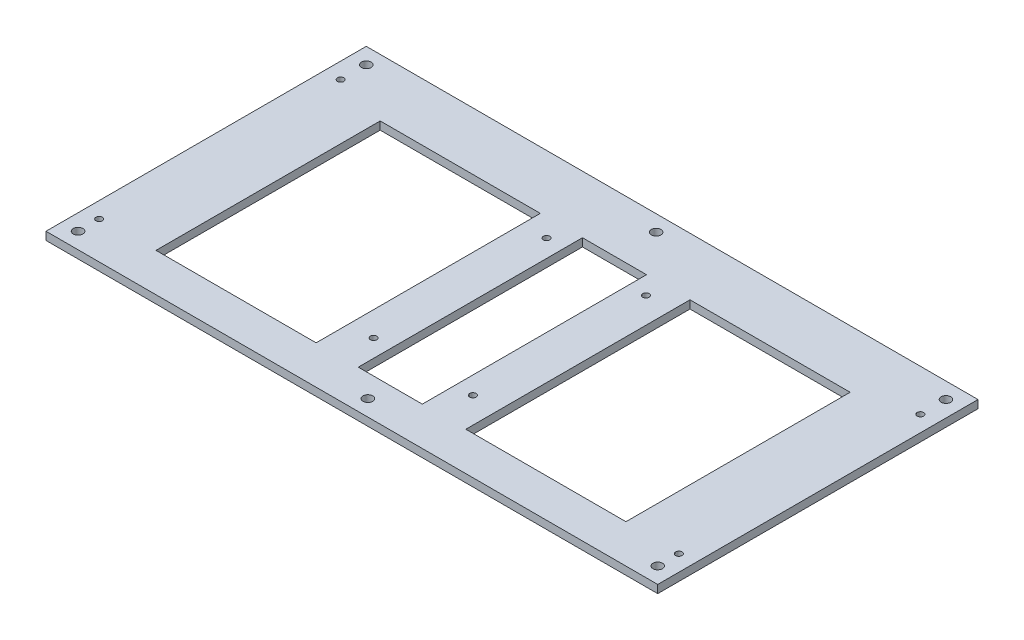
ISO-10303-21;
HEADER;
FILE_DESCRIPTION(('STEP AP214'),'2;1');
FILE_NAME('part.step','',(''),(''),'','','');
FILE_SCHEMA(('AUTOMOTIVE_DESIGN { 1 0 10303 214 1 1 1 1 }'));
ENDSEC;
DATA;
#1=APPLICATION_CONTEXT('core data for automotive mechanical design processes');
#2=APPLICATION_PROTOCOL_DEFINITION('international standard','automotive_design',2000,#1);
#3=PRODUCT_CONTEXT('',#1,'mechanical');
#4=PRODUCT('Part','Part','',(#3));
#5=PRODUCT_RELATED_PRODUCT_CATEGORY('part','',(#4));
#6=PRODUCT_DEFINITION_FORMATION('','',#4);
#7=PRODUCT_DEFINITION_CONTEXT('part definition',#1,'design');
#8=PRODUCT_DEFINITION('design','',#6,#7);
#9=PRODUCT_DEFINITION_SHAPE('','',#8);
#10=(LENGTH_UNIT() NAMED_UNIT(*) SI_UNIT(.MILLI.,.METRE.));
#11=(NAMED_UNIT(*) PLANE_ANGLE_UNIT() SI_UNIT($,.RADIAN.));
#12=(NAMED_UNIT(*) SI_UNIT($,.STERADIAN.) SOLID_ANGLE_UNIT());
#13=UNCERTAINTY_MEASURE_WITH_UNIT(LENGTH_MEASURE(1.E-05),#10,'distance_accuracy_value','');
#14=(GEOMETRIC_REPRESENTATION_CONTEXT(3) GLOBAL_UNCERTAINTY_ASSIGNED_CONTEXT((#13)) GLOBAL_UNIT_ASSIGNED_CONTEXT((#10,
#11,#12)) REPRESENTATION_CONTEXT('',''));
#15=CARTESIAN_POINT('',(0.,0.,0.));
#16=DIRECTION('',(0.,0.,1.));
#17=DIRECTION('',(1.,0.,0.));
#18=AXIS2_PLACEMENT_3D('',#15,#16,#17);
#19=CARTESIAN_POINT('',(0.,5.,94.));
#20=DIRECTION('',(0.,0.,-1.));
#21=DIRECTION('',(-1.,0.,0.));
#22=AXIS2_PLACEMENT_3D('',#19,#20,#21);
#23=PLANE('',#22);
#24=DIRECTION('',(1.,0.,0.));
#25=VECTOR('',#24,1.);
#26=CARTESIAN_POINT('',(0.,0.,94.));
#27=LINE('',#26,#25);
#28=CARTESIAN_POINT('',(-191.,0.,94.));
#29=VERTEX_POINT('',#28);
#30=CARTESIAN_POINT('',(191.,0.,94.));
#31=VERTEX_POINT('',#30);
#32=EDGE_CURVE('E311',#29,#31,#27,.T.);
#33=ORIENTED_EDGE('',*,*,#32,.T.);
#34=DIRECTION('',(0.,-1.,0.));
#35=VECTOR('',#34,1.);
#36=CARTESIAN_POINT('',(191.,5.,94.));
#37=LINE('',#36,#35);
#38=CARTESIAN_POINT('',(191.,5.,94.));
#39=VERTEX_POINT('',#38);
#40=EDGE_CURVE('E353',#39,#31,#37,.T.);
#41=ORIENTED_EDGE('',*,*,#40,.F.);
#42=DIRECTION('',(1.,0.,0.));
#43=VECTOR('',#42,1.);
#44=CARTESIAN_POINT('',(0.,5.,94.));
#45=LINE('',#44,#43);
#46=CARTESIAN_POINT('',(-191.,5.,94.));
#47=VERTEX_POINT('',#46);
#48=EDGE_CURVE('E315',#47,#39,#45,.T.);
#49=ORIENTED_EDGE('',*,*,#48,.F.);
#50=DIRECTION('',(0.,-1.,0.));
#51=VECTOR('',#50,1.);
#52=CARTESIAN_POINT('',(-191.,5.,94.));
#53=LINE('',#52,#51);
#54=EDGE_CURVE('E330',#47,#29,#53,.T.);
#55=ORIENTED_EDGE('',*,*,#54,.T.);
#56=EDGE_LOOP('',(#33,#41,#49,#55));
#57=FACE_BOUND('',#56,.T.);
#58=ADVANCED_FACE('F41',(#57),#23,.F.);
#59=CARTESIAN_POINT('',(191.,5.,0.));
#60=DIRECTION('',(-1.,0.,0.));
#61=DIRECTION('',(0.,0.,1.));
#62=AXIS2_PLACEMENT_3D('',#59,#60,#61);
#63=PLANE('',#62);
#64=DIRECTION('',(0.,0.,-1.));
#65=VECTOR('',#64,1.);
#66=CARTESIAN_POINT('',(191.,0.,0.));
#67=LINE('',#66,#65);
#68=CARTESIAN_POINT('',(191.,0.,-106.));
#69=VERTEX_POINT('',#68);
#70=EDGE_CURVE('E334',#31,#69,#67,.T.);
#71=ORIENTED_EDGE('',*,*,#70,.T.);
#72=DIRECTION('',(0.,-1.,0.));
#73=VECTOR('',#72,1.);
#74=CARTESIAN_POINT('',(191.,5.,-106.));
#75=LINE('',#74,#73);
#76=CARTESIAN_POINT('',(191.,5.,-106.));
#77=VERTEX_POINT('',#76);
#78=EDGE_CURVE('E349',#77,#69,#75,.T.);
#79=ORIENTED_EDGE('',*,*,#78,.F.);
#80=DIRECTION('',(0.,0.,-1.));
#81=VECTOR('',#80,1.);
#82=CARTESIAN_POINT('',(191.,5.,0.));
#83=LINE('',#82,#81);
#84=EDGE_CURVE('E319',#39,#77,#83,.T.);
#85=ORIENTED_EDGE('',*,*,#84,.F.);
#86=ORIENTED_EDGE('',*,*,#40,.T.);
#87=EDGE_LOOP('',(#71,#79,#85,#86));
#88=FACE_BOUND('',#87,.T.);
#89=ADVANCED_FACE('F438',(#88),#63,.F.);
#90=CARTESIAN_POINT('',(0.,5.,-106.));
#91=DIRECTION('',(0.,0.,1.));
#92=DIRECTION('',(1.,0.,0.));
#93=AXIS2_PLACEMENT_3D('',#90,#91,#92);
#94=PLANE('',#93);
#95=DIRECTION('',(-1.,0.,0.));
#96=VECTOR('',#95,1.);
#97=CARTESIAN_POINT('',(0.,0.,-106.));
#98=LINE('',#97,#96);
#99=CARTESIAN_POINT('',(-191.,0.,-106.));
#100=VERTEX_POINT('',#99);
#101=EDGE_CURVE('E337',#69,#100,#98,.T.);
#102=ORIENTED_EDGE('',*,*,#101,.T.);
#103=DIRECTION('',(0.,-1.,0.));
#104=VECTOR('',#103,1.);
#105=CARTESIAN_POINT('',(-191.,5.,-106.));
#106=LINE('',#105,#104);
#107=CARTESIAN_POINT('',(-191.,5.,-106.));
#108=VERTEX_POINT('',#107);
#109=EDGE_CURVE('E346',#108,#100,#106,.T.);
#110=ORIENTED_EDGE('',*,*,#109,.F.);
#111=DIRECTION('',(-1.,0.,0.));
#112=VECTOR('',#111,1.);
#113=CARTESIAN_POINT('',(0.,5.,-106.));
#114=LINE('',#113,#112);
#115=EDGE_CURVE('E323',#77,#108,#114,.T.);
#116=ORIENTED_EDGE('',*,*,#115,.F.);
#117=ORIENTED_EDGE('',*,*,#78,.T.);
#118=EDGE_LOOP('',(#102,#110,#116,#117));
#119=FACE_BOUND('',#118,.T.);
#120=ADVANCED_FACE('F443',(#119),#94,.F.);
#121=CARTESIAN_POINT('',(-191.,5.,0.));
#122=DIRECTION('',(-1.,0.,0.));
#123=DIRECTION('',(0.,0.,1.));
#124=AXIS2_PLACEMENT_3D('',#121,#122,#123);
#125=PLANE('',#124);
#126=DIRECTION('',(0.,0.,-1.));
#127=VECTOR('',#126,1.);
#128=CARTESIAN_POINT('',(-191.,0.,0.));
#129=LINE('',#128,#127);
#130=EDGE_CURVE('E320',#29,#100,#129,.T.);
#131=ORIENTED_EDGE('',*,*,#130,.F.);
#132=ORIENTED_EDGE('',*,*,#54,.F.);
#133=DIRECTION('',(0.,0.,-1.));
#134=VECTOR('',#133,1.);
#135=CARTESIAN_POINT('',(-191.,5.,0.));
#136=LINE('',#135,#134);
#137=EDGE_CURVE('E326',#47,#108,#136,.T.);
#138=ORIENTED_EDGE('',*,*,#137,.T.);
#139=ORIENTED_EDGE('',*,*,#109,.T.);
#140=EDGE_LOOP('',(#131,#132,#138,#139));
#141=FACE_BOUND('',#140,.T.);
#142=ADVANCED_FACE('F452',(#141),#125,.T.);
#143=CARTESIAN_POINT('',(0.,5.,0.));
#144=DIRECTION('',(0.,1.,0.));
#145=DIRECTION('',(0.,0.,1.));
#146=AXIS2_PLACEMENT_3D('',#143,#144,#145);
#147=PLANE('',#146);
#148=CARTESIAN_POINT('',(0.,5.,-96.));
#149=DIRECTION('',(0.,1.,0.));
#150=DIRECTION('',(0.,0.,1.));
#151=AXIS2_PLACEMENT_3D('',#148,#149,#150);
#152=CIRCLE('',#151,3.);
#153=CARTESIAN_POINT('',(0.,5.,-93.));
#154=VERTEX_POINT('',#153);
#155=EDGE_CURVE('E812',#154,#154,#152,.T.);
#156=ORIENTED_EDGE('',*,*,#155,.F.);
#157=EDGE_LOOP('',(#156));
#158=FACE_BOUND('',#157,.T.);
#159=CARTESIAN_POINT('',(-181.,5.,84.));
#160=DIRECTION('',(0.,1.,0.));
#161=DIRECTION('',(0.,0.,1.));
#162=AXIS2_PLACEMENT_3D('',#159,#160,#161);
#163=CIRCLE('',#162,2.99999999999999);
#164=CARTESIAN_POINT('',(-181.,5.,87.));
#165=VERTEX_POINT('',#164);
#166=EDGE_CURVE('E808',#165,#165,#163,.T.);
#167=ORIENTED_EDGE('',*,*,#166,.F.);
#168=EDGE_LOOP('',(#167));
#169=FACE_BOUND('',#168,.T.);
#170=CARTESIAN_POINT('',(-181.,5.,-96.));
#171=DIRECTION('',(0.,1.,0.));
#172=DIRECTION('',(0.,0.,1.));
#173=AXIS2_PLACEMENT_3D('',#170,#171,#172);
#174=CIRCLE('',#173,2.99999999999999);
#175=CARTESIAN_POINT('',(-181.,5.,-93.));
#176=VERTEX_POINT('',#175);
#177=EDGE_CURVE('E739',#176,#176,#174,.T.);
#178=ORIENTED_EDGE('',*,*,#177,.F.);
#179=EDGE_LOOP('',(#178));
#180=FACE_BOUND('',#179,.T.);
#181=CARTESIAN_POINT('',(181.,5.,84.));
#182=DIRECTION('',(0.,1.,0.));
#183=DIRECTION('',(0.,0.,1.));
#184=AXIS2_PLACEMENT_3D('',#181,#182,#183);
#185=CIRCLE('',#184,2.99999999999999);
#186=CARTESIAN_POINT('',(181.,5.,87.));
#187=VERTEX_POINT('',#186);
#188=EDGE_CURVE('E805',#187,#187,#185,.T.);
#189=ORIENTED_EDGE('',*,*,#188,.F.);
#190=EDGE_LOOP('',(#189));
#191=FACE_BOUND('',#190,.T.);
#192=CARTESIAN_POINT('',(0.,5.,84.));
#193=DIRECTION('',(0.,1.,0.));
#194=DIRECTION('',(0.,0.,1.));
#195=AXIS2_PLACEMENT_3D('',#192,#193,#194);
#196=CIRCLE('',#195,3.);
#197=CARTESIAN_POINT('',(0.,5.,87.));
#198=VERTEX_POINT('',#197);
#199=EDGE_CURVE('E815',#198,#198,#196,.T.);
#200=ORIENTED_EDGE('',*,*,#199,.F.);
#201=EDGE_LOOP('',(#200));
#202=FACE_BOUND('',#201,.T.);
#203=CARTESIAN_POINT('',(181.,5.,-96.));
#204=DIRECTION('',(0.,1.,0.));
#205=DIRECTION('',(0.,0.,1.));
#206=AXIS2_PLACEMENT_3D('',#203,#204,#205);
#207=CIRCLE('',#206,2.99999999999999);
#208=CARTESIAN_POINT('',(181.,5.,-93.));
#209=VERTEX_POINT('',#208);
#210=EDGE_CURVE('E402',#209,#209,#207,.T.);
#211=ORIENTED_EDGE('',*,*,#210,.F.);
#212=EDGE_LOOP('',(#211));
#213=FACE_BOUND('',#212,.T.);
#214=DIRECTION('',(0.,0.,1.));
#215=VECTOR('',#214,1.);
#216=CARTESIAN_POINT('',(-146.318135120669,5.,-70.));
#217=LINE('',#216,#215);
#218=CARTESIAN_POINT('',(-146.318135120669,5.,-70.));
#219=VERTEX_POINT('',#218);
#220=CARTESIAN_POINT('',(-146.318135120669,5.,70.0000000000001));
#221=VERTEX_POINT('',#220);
#222=EDGE_CURVE('E58',#219,#221,#217,.T.);
#223=ORIENTED_EDGE('',*,*,#222,.F.);
#224=DIRECTION('',(-1.,0.,0.));
#225=VECTOR('',#224,1.);
#226=CARTESIAN_POINT('',(-46.3181351206686,5.,-70.));
#227=LINE('',#226,#225);
#228=CARTESIAN_POINT('',(-46.3181351206686,5.,-70.));
#229=VERTEX_POINT('',#228);
#230=EDGE_CURVE('E207',#229,#219,#227,.T.);
#231=ORIENTED_EDGE('',*,*,#230,.F.);
#232=DIRECTION('',(0.,0.,-1.));
#233=VECTOR('',#232,1.);
#234=CARTESIAN_POINT('',(-46.3181351206686,5.,-70.));
#235=LINE('',#234,#233);
#236=CARTESIAN_POINT('',(-46.3181351206686,5.,70.));
#237=VERTEX_POINT('',#236);
#238=EDGE_CURVE('E203',#237,#229,#235,.T.);
#239=ORIENTED_EDGE('',*,*,#238,.F.);
#240=DIRECTION('',(1.,0.,0.));
#241=VECTOR('',#240,1.);
#242=CARTESIAN_POINT('',(-46.3181351206686,5.,70.));
#243=LINE('',#242,#241);
#244=EDGE_CURVE('E199',#221,#237,#243,.T.);
#245=ORIENTED_EDGE('',*,*,#244,.F.);
#246=EDGE_LOOP('',(#223,#231,#239,#245));
#247=FACE_BOUND('',#246,.T.);
#248=DIRECTION('',(0.,0.,-1.));
#249=VECTOR('',#248,1.);
#250=CARTESIAN_POINT('',(147.154879489608,5.,-70.));
#251=LINE('',#250,#249);
#252=CARTESIAN_POINT('',(147.154879489608,5.,70.));
#253=VERTEX_POINT('',#252);
#254=CARTESIAN_POINT('',(147.154879489608,5.,-70.));
#255=VERTEX_POINT('',#254);
#256=EDGE_CURVE('E66',#253,#255,#251,.T.);
#257=ORIENTED_EDGE('',*,*,#256,.F.);
#258=DIRECTION('',(1.,0.,0.));
#259=VECTOR('',#258,1.);
#260=CARTESIAN_POINT('',(47.154879489608,5.,70.));
#261=LINE('',#260,#259);
#262=CARTESIAN_POINT('',(47.154879489608,5.,70.));
#263=VERTEX_POINT('',#262);
#264=EDGE_CURVE('E182',#263,#253,#261,.T.);
#265=ORIENTED_EDGE('',*,*,#264,.F.);
#266=DIRECTION('',(0.,0.,1.));
#267=VECTOR('',#266,1.);
#268=CARTESIAN_POINT('',(47.154879489608,5.,-70.));
#269=LINE('',#268,#267);
#270=CARTESIAN_POINT('',(47.154879489608,5.,-70.));
#271=VERTEX_POINT('',#270);
#272=EDGE_CURVE('E163',#271,#263,#269,.T.);
#273=ORIENTED_EDGE('',*,*,#272,.F.);
#274=DIRECTION('',(-1.,0.,0.));
#275=VECTOR('',#274,1.);
#276=CARTESIAN_POINT('',(47.154879489608,5.,-70.));
#277=LINE('',#276,#275);
#278=EDGE_CURVE('E174',#255,#271,#277,.T.);
#279=ORIENTED_EDGE('',*,*,#278,.F.);
#280=EDGE_LOOP('',(#257,#265,#273,#279));
#281=FACE_BOUND('',#280,.T.);
#282=DIRECTION('',(0.,0.,-1.));
#283=VECTOR('',#282,1.);
#284=CARTESIAN_POINT('',(20.,5.,-70.));
#285=LINE('',#284,#283);
#286=CARTESIAN_POINT('',(20.,5.,70.));
#287=VERTEX_POINT('',#286);
#288=CARTESIAN_POINT('',(20.,5.,-70.));
#289=VERTEX_POINT('',#288);
#290=EDGE_CURVE('E192',#287,#289,#285,.T.);
#291=ORIENTED_EDGE('',*,*,#290,.F.);
#292=DIRECTION('',(1.,0.,0.));
#293=VECTOR('',#292,1.);
#294=CARTESIAN_POINT('',(-20.,5.,70.));
#295=LINE('',#294,#293);
#296=CARTESIAN_POINT('',(-20.,5.,70.));
#297=VERTEX_POINT('',#296);
#298=EDGE_CURVE('E233',#297,#287,#295,.T.);
#299=ORIENTED_EDGE('',*,*,#298,.F.);
#300=DIRECTION('',(0.,0.,1.));
#301=VECTOR('',#300,1.);
#302=CARTESIAN_POINT('',(-20.,5.,-70.));
#303=LINE('',#302,#301);
#304=CARTESIAN_POINT('',(-20.,5.,-70.));
#305=VERTEX_POINT('',#304);
#306=EDGE_CURVE('E229',#305,#297,#303,.T.);
#307=ORIENTED_EDGE('',*,*,#306,.F.);
#308=DIRECTION('',(-1.,0.,0.));
#309=VECTOR('',#308,1.);
#310=CARTESIAN_POINT('',(-20.,5.,-70.));
#311=LINE('',#310,#309);
#312=EDGE_CURVE('E225',#289,#305,#311,.T.);
#313=ORIENTED_EDGE('',*,*,#312,.F.);
#314=EDGE_LOOP('',(#291,#299,#307,#313));
#315=FACE_BOUND('',#314,.T.);
#316=CARTESIAN_POINT('',(-181.,5.,-80.));
#317=DIRECTION('',(0.,1.,0.));
#318=DIRECTION('',(0.,0.,1.));
#319=AXIS2_PLACEMENT_3D('',#316,#317,#318);
#320=CIRCLE('',#319,2.);
#321=CARTESIAN_POINT('',(-181.,5.,-78.));
#322=VERTEX_POINT('',#321);
#323=EDGE_CURVE('E280',#322,#322,#320,.T.);
#324=ORIENTED_EDGE('',*,*,#323,.F.);
#325=EDGE_LOOP('',(#324));
#326=FACE_BOUND('',#325,.T.);
#327=CARTESIAN_POINT('',(181.,5.,-80.));
#328=DIRECTION('',(0.,1.,0.));
#329=DIRECTION('',(0.,0.,1.));
#330=AXIS2_PLACEMENT_3D('',#327,#328,#329);
#331=CIRCLE('',#330,2.);
#332=CARTESIAN_POINT('',(181.,5.,-78.));
#333=VERTEX_POINT('',#332);
#334=EDGE_CURVE('E288',#333,#333,#331,.T.);
#335=ORIENTED_EDGE('',*,*,#334,.F.);
#336=EDGE_LOOP('',(#335));
#337=FACE_BOUND('',#336,.T.);
#338=CARTESIAN_POINT('',(181.,5.,70.8));
#339=DIRECTION('',(0.,1.,0.));
#340=DIRECTION('',(0.,0.,1.));
#341=AXIS2_PLACEMENT_3D('',#338,#339,#340);
#342=CIRCLE('',#341,2.);
#343=CARTESIAN_POINT('',(181.,5.,72.8));
#344=VERTEX_POINT('',#343);
#345=EDGE_CURVE('E296',#344,#344,#342,.T.);
#346=ORIENTED_EDGE('',*,*,#345,.F.);
#347=EDGE_LOOP('',(#346));
#348=FACE_BOUND('',#347,.T.);
#349=CARTESIAN_POINT('',(31.,5.,-58.6));
#350=DIRECTION('',(0.,1.,0.));
#351=DIRECTION('',(0.,0.,1.));
#352=AXIS2_PLACEMENT_3D('',#349,#350,#351);
#353=CIRCLE('',#352,2.00000000000002);
#354=CARTESIAN_POINT('',(31.,5.,-56.6));
#355=VERTEX_POINT('',#354);
#356=EDGE_CURVE('E263',#355,#355,#353,.T.);
#357=ORIENTED_EDGE('',*,*,#356,.F.);
#358=EDGE_LOOP('',(#357));
#359=FACE_BOUND('',#358,.T.);
#360=CARTESIAN_POINT('',(-31.,5.,49.4));
#361=DIRECTION('',(0.,1.,0.));
#362=DIRECTION('',(0.,0.,1.));
#363=AXIS2_PLACEMENT_3D('',#360,#361,#362);
#364=CIRCLE('',#363,2.00000000000001);
#365=CARTESIAN_POINT('',(-31.,5.,51.4));
#366=VERTEX_POINT('',#365);
#367=EDGE_CURVE('E241',#366,#366,#364,.T.);
#368=ORIENTED_EDGE('',*,*,#367,.F.);
#369=EDGE_LOOP('',(#368));
#370=FACE_BOUND('',#369,.T.);
#371=CARTESIAN_POINT('',(31.,5.,49.4));
#372=DIRECTION('',(0.,1.,0.));
#373=DIRECTION('',(0.,0.,1.));
#374=AXIS2_PLACEMENT_3D('',#371,#372,#373);
#375=CIRCLE('',#374,2.00000000000001);
#376=CARTESIAN_POINT('',(31.,5.,51.4));
#377=VERTEX_POINT('',#376);
#378=EDGE_CURVE('E255',#377,#377,#375,.T.);
#379=ORIENTED_EDGE('',*,*,#378,.F.);
#380=EDGE_LOOP('',(#379));
#381=FACE_BOUND('',#380,.T.);
#382=CARTESIAN_POINT('',(-181.,5.,70.8));
#383=DIRECTION('',(0.,1.,0.));
#384=DIRECTION('',(0.,0.,1.));
#385=AXIS2_PLACEMENT_3D('',#382,#383,#384);
#386=CIRCLE('',#385,2.);
#387=CARTESIAN_POINT('',(-181.,5.,72.8));
#388=VERTEX_POINT('',#387);
#389=EDGE_CURVE('E264',#388,#388,#386,.T.);
#390=ORIENTED_EDGE('',*,*,#389,.F.);
#391=EDGE_LOOP('',(#390));
#392=FACE_BOUND('',#391,.T.);
#393=CARTESIAN_POINT('',(-31.,5.,-58.6));
#394=DIRECTION('',(0.,1.,0.));
#395=DIRECTION('',(0.,0.,1.));
#396=AXIS2_PLACEMENT_3D('',#393,#394,#395);
#397=CIRCLE('',#396,2.00000000000001);
#398=CARTESIAN_POINT('',(-31.,5.,-56.6));
#399=VERTEX_POINT('',#398);
#400=EDGE_CURVE('E279',#399,#399,#397,.T.);
#401=ORIENTED_EDGE('',*,*,#400,.F.);
#402=EDGE_LOOP('',(#401));
#403=FACE_BOUND('',#402,.T.);
#404=ORIENTED_EDGE('',*,*,#48,.T.);
#405=ORIENTED_EDGE('',*,*,#84,.T.);
#406=ORIENTED_EDGE('',*,*,#115,.T.);
#407=ORIENTED_EDGE('',*,*,#137,.F.);
#408=EDGE_LOOP('',(#404,#405,#406,#407));
#409=FACE_BOUND('',#408,.T.);
#410=ADVANCED_FACE('F179',(#158,#169,#180,#191,#202,#213,#247,#281,#315,#326,#337,#348,#359,
#370,#381,#392,#403,#409),#147,.T.);
#411=CARTESIAN_POINT('',(0.,0.,0.));
#412=DIRECTION('',(0.,1.,0.));
#413=DIRECTION('',(0.,0.,1.));
#414=AXIS2_PLACEMENT_3D('',#411,#412,#413);
#415=PLANE('',#414);
#416=CARTESIAN_POINT('',(0.,0.,-96.));
#417=DIRECTION('',(0.,1.,0.));
#418=DIRECTION('',(0.,0.,1.));
#419=AXIS2_PLACEMENT_3D('',#416,#417,#418);
#420=CIRCLE('',#419,3.);
#421=CARTESIAN_POINT('',(0.,0.,-93.));
#422=VERTEX_POINT('',#421);
#423=EDGE_CURVE('E44',#422,#422,#420,.T.);
#424=ORIENTED_EDGE('',*,*,#423,.T.);
#425=EDGE_LOOP('',(#424));
#426=FACE_BOUND('',#425,.T.);
#427=CARTESIAN_POINT('',(-181.,0.,84.));
#428=DIRECTION('',(0.,1.,0.));
#429=DIRECTION('',(0.,0.,1.));
#430=AXIS2_PLACEMENT_3D('',#427,#428,#429);
#431=CIRCLE('',#430,2.99999999999999);
#432=CARTESIAN_POINT('',(-181.,0.,87.));
#433=VERTEX_POINT('',#432);
#434=EDGE_CURVE('E413',#433,#433,#431,.T.);
#435=ORIENTED_EDGE('',*,*,#434,.T.);
#436=EDGE_LOOP('',(#435));
#437=FACE_BOUND('',#436,.T.);
#438=CARTESIAN_POINT('',(-181.,0.,-96.));
#439=DIRECTION('',(0.,1.,0.));
#440=DIRECTION('',(0.,0.,1.));
#441=AXIS2_PLACEMENT_3D('',#438,#439,#440);
#442=CIRCLE('',#441,2.99999999999999);
#443=CARTESIAN_POINT('',(-181.,0.,-93.));
#444=VERTEX_POINT('',#443);
#445=EDGE_CURVE('E410',#444,#444,#442,.T.);
#446=ORIENTED_EDGE('',*,*,#445,.T.);
#447=EDGE_LOOP('',(#446));
#448=FACE_BOUND('',#447,.T.);
#449=CARTESIAN_POINT('',(181.,0.,84.));
#450=DIRECTION('',(0.,1.,0.));
#451=DIRECTION('',(0.,0.,1.));
#452=AXIS2_PLACEMENT_3D('',#449,#450,#451);
#453=CIRCLE('',#452,2.99999999999999);
#454=CARTESIAN_POINT('',(181.,0.,87.));
#455=VERTEX_POINT('',#454);
#456=EDGE_CURVE('E406',#455,#455,#453,.T.);
#457=ORIENTED_EDGE('',*,*,#456,.T.);
#458=EDGE_LOOP('',(#457));
#459=FACE_BOUND('',#458,.T.);
#460=CARTESIAN_POINT('',(0.,0.,84.));
#461=DIRECTION('',(0.,1.,0.));
#462=DIRECTION('',(0.,0.,1.));
#463=AXIS2_PLACEMENT_3D('',#460,#461,#462);
#464=CIRCLE('',#463,3.);
#465=CARTESIAN_POINT('',(0.,0.,87.));
#466=VERTEX_POINT('',#465);
#467=EDGE_CURVE('E401',#466,#466,#464,.T.);
#468=ORIENTED_EDGE('',*,*,#467,.T.);
#469=EDGE_LOOP('',(#468));
#470=FACE_BOUND('',#469,.T.);
#471=CARTESIAN_POINT('',(181.,0.,-96.));
#472=DIRECTION('',(0.,1.,0.));
#473=DIRECTION('',(0.,0.,1.));
#474=AXIS2_PLACEMENT_3D('',#471,#472,#473);
#475=CIRCLE('',#474,2.99999999999999);
#476=CARTESIAN_POINT('',(181.,0.,-93.));
#477=VERTEX_POINT('',#476);
#478=EDGE_CURVE('E397',#477,#477,#475,.T.);
#479=ORIENTED_EDGE('',*,*,#478,.T.);
#480=EDGE_LOOP('',(#479));
#481=FACE_BOUND('',#480,.T.);
#482=DIRECTION('',(-1.,0.,0.));
#483=VECTOR('',#482,1.);
#484=CARTESIAN_POINT('',(0.,0.,-70.));
#485=LINE('',#484,#483);
#486=CARTESIAN_POINT('',(-46.3181351206686,0.,-70.));
#487=VERTEX_POINT('',#486);
#488=CARTESIAN_POINT('',(-146.318135120669,0.,-70.));
#489=VERTEX_POINT('',#488);
#490=EDGE_CURVE('E50',#487,#489,#485,.T.);
#491=ORIENTED_EDGE('',*,*,#490,.T.);
#492=DIRECTION('',(0.,0.,1.));
#493=VECTOR('',#492,1.);
#494=CARTESIAN_POINT('',(-146.318135120669,0.,0.));
#495=LINE('',#494,#493);
#496=CARTESIAN_POINT('',(-146.318135120669,0.,70.0000000000001));
#497=VERTEX_POINT('',#496);
#498=EDGE_CURVE('E11',#489,#497,#495,.T.);
#499=ORIENTED_EDGE('',*,*,#498,.T.);
#500=DIRECTION('',(1.,0.,0.));
#501=VECTOR('',#500,1.);
#502=CARTESIAN_POINT('',(0.,0.,70.));
#503=LINE('',#502,#501);
#504=CARTESIAN_POINT('',(-46.3181351206686,0.,70.));
#505=VERTEX_POINT('',#504);
#506=EDGE_CURVE('E386',#497,#505,#503,.T.);
#507=ORIENTED_EDGE('',*,*,#506,.T.);
#508=DIRECTION('',(0.,0.,-1.));
#509=VECTOR('',#508,1.);
#510=CARTESIAN_POINT('',(-46.3181351206686,0.,0.));
#511=LINE('',#510,#509);
#512=EDGE_CURVE('E390',#505,#487,#511,.T.);
#513=ORIENTED_EDGE('',*,*,#512,.T.);
#514=EDGE_LOOP('',(#491,#499,#507,#513));
#515=FACE_BOUND('',#514,.T.);
#516=DIRECTION('',(1.,0.,0.));
#517=VECTOR('',#516,1.);
#518=CARTESIAN_POINT('',(0.,0.,70.));
#519=LINE('',#518,#517);
#520=CARTESIAN_POINT('',(47.154879489608,0.,70.));
#521=VERTEX_POINT('',#520);
#522=CARTESIAN_POINT('',(147.154879489608,0.,70.));
#523=VERTEX_POINT('',#522);
#524=EDGE_CURVE('E378',#521,#523,#519,.T.);
#525=ORIENTED_EDGE('',*,*,#524,.T.);
#526=DIRECTION('',(0.,0.,-1.));
#527=VECTOR('',#526,1.);
#528=CARTESIAN_POINT('',(147.154879489608,0.,0.));
#529=LINE('',#528,#527);
#530=CARTESIAN_POINT('',(147.154879489608,0.,-70.));
#531=VERTEX_POINT('',#530);
#532=EDGE_CURVE('E382',#523,#531,#529,.T.);
#533=ORIENTED_EDGE('',*,*,#532,.T.);
#534=DIRECTION('',(-1.,0.,0.));
#535=VECTOR('',#534,1.);
#536=CARTESIAN_POINT('',(0.,0.,-70.));
#537=LINE('',#536,#535);
#538=CARTESIAN_POINT('',(47.154879489608,0.,-70.));
#539=VERTEX_POINT('',#538);
#540=EDGE_CURVE('E373',#531,#539,#537,.T.);
#541=ORIENTED_EDGE('',*,*,#540,.T.);
#542=DIRECTION('',(0.,0.,1.));
#543=VECTOR('',#542,1.);
#544=CARTESIAN_POINT('',(47.154879489608,0.,0.));
#545=LINE('',#544,#543);
#546=EDGE_CURVE('E166',#539,#521,#545,.T.);
#547=ORIENTED_EDGE('',*,*,#546,.T.);
#548=EDGE_LOOP('',(#525,#533,#541,#547));
#549=FACE_BOUND('',#548,.T.);
#550=DIRECTION('',(1.,0.,0.));
#551=VECTOR('',#550,1.);
#552=CARTESIAN_POINT('',(0.,0.,70.));
#553=LINE('',#552,#551);
#554=CARTESIAN_POINT('',(-20.,0.,70.));
#555=VERTEX_POINT('',#554);
#556=CARTESIAN_POINT('',(20.,0.,70.));
#557=VERTEX_POINT('',#556);
#558=EDGE_CURVE('E365',#555,#557,#553,.T.);
#559=ORIENTED_EDGE('',*,*,#558,.T.);
#560=DIRECTION('',(0.,0.,-1.));
#561=VECTOR('',#560,1.);
#562=CARTESIAN_POINT('',(20.,0.,0.));
#563=LINE('',#562,#561);
#564=CARTESIAN_POINT('',(20.,0.,-70.));
#565=VERTEX_POINT('',#564);
#566=EDGE_CURVE('E369',#557,#565,#563,.T.);
#567=ORIENTED_EDGE('',*,*,#566,.T.);
#568=DIRECTION('',(-1.,0.,0.));
#569=VECTOR('',#568,1.);
#570=CARTESIAN_POINT('',(0.,0.,-70.));
#571=LINE('',#570,#569);
#572=CARTESIAN_POINT('',(-20.,0.,-70.));
#573=VERTEX_POINT('',#572);
#574=EDGE_CURVE('E357',#565,#573,#571,.T.);
#575=ORIENTED_EDGE('',*,*,#574,.T.);
#576=DIRECTION('',(0.,0.,1.));
#577=VECTOR('',#576,1.);
#578=CARTESIAN_POINT('',(-20.,0.,0.));
#579=LINE('',#578,#577);
#580=EDGE_CURVE('E361',#573,#555,#579,.T.);
#581=ORIENTED_EDGE('',*,*,#580,.T.);
#582=EDGE_LOOP('',(#559,#567,#575,#581));
#583=FACE_BOUND('',#582,.T.);
#584=CARTESIAN_POINT('',(-181.,0.,-80.));
#585=DIRECTION('',(0.,1.,0.));
#586=DIRECTION('',(0.,0.,1.));
#587=AXIS2_PLACEMENT_3D('',#584,#585,#586);
#588=CIRCLE('',#587,2.);
#589=CARTESIAN_POINT('',(-181.,0.,-78.));
#590=VERTEX_POINT('',#589);
#591=EDGE_CURVE('E275',#590,#590,#588,.T.);
#592=ORIENTED_EDGE('',*,*,#591,.T.);
#593=EDGE_LOOP('',(#592));
#594=FACE_BOUND('',#593,.T.);
#595=CARTESIAN_POINT('',(181.,0.,-80.));
#596=DIRECTION('',(0.,1.,0.));
#597=DIRECTION('',(0.,0.,1.));
#598=AXIS2_PLACEMENT_3D('',#595,#596,#597);
#599=CIRCLE('',#598,2.);
#600=CARTESIAN_POINT('',(181.,0.,-78.));
#601=VERTEX_POINT('',#600);
#602=EDGE_CURVE('E284',#601,#601,#599,.T.);
#603=ORIENTED_EDGE('',*,*,#602,.T.);
#604=EDGE_LOOP('',(#603));
#605=FACE_BOUND('',#604,.T.);
#606=CARTESIAN_POINT('',(181.,0.,70.8));
#607=DIRECTION('',(0.,1.,0.));
#608=DIRECTION('',(0.,0.,1.));
#609=AXIS2_PLACEMENT_3D('',#606,#607,#608);
#610=CIRCLE('',#609,2.);
#611=CARTESIAN_POINT('',(181.,0.,72.8));
#612=VERTEX_POINT('',#611);
#613=EDGE_CURVE('E292',#612,#612,#610,.T.);
#614=ORIENTED_EDGE('',*,*,#613,.T.);
#615=EDGE_LOOP('',(#614));
#616=FACE_BOUND('',#615,.T.);
#617=CARTESIAN_POINT('',(31.,0.,-58.6));
#618=DIRECTION('',(0.,1.,0.));
#619=DIRECTION('',(0.,0.,1.));
#620=AXIS2_PLACEMENT_3D('',#617,#618,#619);
#621=CIRCLE('',#620,2.00000000000002);
#622=CARTESIAN_POINT('',(31.,0.,-56.6));
#623=VERTEX_POINT('',#622);
#624=EDGE_CURVE('E300',#623,#623,#621,.T.);
#625=ORIENTED_EDGE('',*,*,#624,.T.);
#626=EDGE_LOOP('',(#625));
#627=FACE_BOUND('',#626,.T.);
#628=CARTESIAN_POINT('',(-31.,0.,49.4));
#629=DIRECTION('',(0.,1.,0.));
#630=DIRECTION('',(0.,0.,1.));
#631=AXIS2_PLACEMENT_3D('',#628,#629,#630);
#632=CIRCLE('',#631,2.00000000000001);
#633=CARTESIAN_POINT('',(-31.,0.,51.4));
#634=VERTEX_POINT('',#633);
#635=EDGE_CURVE('E251',#634,#634,#632,.T.);
#636=ORIENTED_EDGE('',*,*,#635,.T.);
#637=EDGE_LOOP('',(#636));
#638=FACE_BOUND('',#637,.T.);
#639=CARTESIAN_POINT('',(31.,0.,49.4));
#640=DIRECTION('',(0.,1.,0.));
#641=DIRECTION('',(0.,0.,1.));
#642=AXIS2_PLACEMENT_3D('',#639,#640,#641);
#643=CIRCLE('',#642,2.00000000000001);
#644=CARTESIAN_POINT('',(31.,0.,51.4));
#645=VERTEX_POINT('',#644);
#646=EDGE_CURVE('E268',#645,#645,#643,.T.);
#647=ORIENTED_EDGE('',*,*,#646,.T.);
#648=EDGE_LOOP('',(#647));
#649=FACE_BOUND('',#648,.T.);
#650=CARTESIAN_POINT('',(-181.,0.,70.8));
#651=DIRECTION('',(0.,1.,0.));
#652=DIRECTION('',(0.,0.,1.));
#653=AXIS2_PLACEMENT_3D('',#650,#651,#652);
#654=CIRCLE('',#653,2.);
#655=CARTESIAN_POINT('',(-181.,0.,72.8));
#656=VERTEX_POINT('',#655);
#657=EDGE_CURVE('E259',#656,#656,#654,.T.);
#658=ORIENTED_EDGE('',*,*,#657,.T.);
#659=EDGE_LOOP('',(#658));
#660=FACE_BOUND('',#659,.T.);
#661=CARTESIAN_POINT('',(-31.,0.,-58.6));
#662=DIRECTION('',(0.,1.,0.));
#663=DIRECTION('',(0.,0.,1.));
#664=AXIS2_PLACEMENT_3D('',#661,#662,#663);
#665=CIRCLE('',#664,2.00000000000001);
#666=CARTESIAN_POINT('',(-31.,0.,-56.6));
#667=VERTEX_POINT('',#666);
#668=EDGE_CURVE('E307',#667,#667,#665,.T.);
#669=ORIENTED_EDGE('',*,*,#668,.T.);
#670=EDGE_LOOP('',(#669));
#671=FACE_BOUND('',#670,.T.);
#672=ORIENTED_EDGE('',*,*,#32,.F.);
#673=ORIENTED_EDGE('',*,*,#130,.T.);
#674=ORIENTED_EDGE('',*,*,#101,.F.);
#675=ORIENTED_EDGE('',*,*,#70,.F.);
#676=EDGE_LOOP('',(#672,#673,#674,#675));
#677=FACE_BOUND('',#676,.T.);
#678=ADVANCED_FACE('F422',(#426,#437,#448,#459,#470,#481,#515,#549,#583,#594,#605,#616,#627,
#638,#649,#660,#671,#677),#415,.F.);
#679=CARTESIAN_POINT('',(-31.,0.,-58.6));
#680=DIRECTION('',(0.,1.,0.));
#681=DIRECTION('',(0.,0.,1.));
#682=AXIS2_PLACEMENT_3D('',#679,#680,#681);
#683=CYLINDRICAL_SURFACE('',#682,2.00000000000001);
#684=ORIENTED_EDGE('',*,*,#668,.F.);
#685=EDGE_LOOP('',(#684));
#686=FACE_BOUND('',#685,.T.);
#687=ORIENTED_EDGE('',*,*,#400,.T.);
#688=EDGE_LOOP('',(#687));
#689=FACE_BOUND('',#688,.T.);
#690=ADVANCED_FACE('F466',(#686,#689),#683,.F.);
#691=CARTESIAN_POINT('',(-181.,0.,70.8));
#692=DIRECTION('',(0.,1.,0.));
#693=DIRECTION('',(0.,0.,1.));
#694=AXIS2_PLACEMENT_3D('',#691,#692,#693);
#695=CYLINDRICAL_SURFACE('',#694,2.);
#696=ORIENTED_EDGE('',*,*,#657,.F.);
#697=EDGE_LOOP('',(#696));
#698=FACE_BOUND('',#697,.T.);
#699=ORIENTED_EDGE('',*,*,#389,.T.);
#700=EDGE_LOOP('',(#699));
#701=FACE_BOUND('',#700,.T.);
#702=ADVANCED_FACE('F493',(#698,#701),#695,.F.);
#703=CARTESIAN_POINT('',(31.,0.,49.4));
#704=DIRECTION('',(0.,1.,0.));
#705=DIRECTION('',(0.,0.,1.));
#706=AXIS2_PLACEMENT_3D('',#703,#704,#705);
#707=CYLINDRICAL_SURFACE('',#706,2.00000000000001);
#708=ORIENTED_EDGE('',*,*,#646,.F.);
#709=EDGE_LOOP('',(#708));
#710=FACE_BOUND('',#709,.T.);
#711=ORIENTED_EDGE('',*,*,#378,.T.);
#712=EDGE_LOOP('',(#711));
#713=FACE_BOUND('',#712,.T.);
#714=ADVANCED_FACE('F503',(#710,#713),#707,.F.);
#715=CARTESIAN_POINT('',(-31.,0.,49.4));
#716=DIRECTION('',(0.,1.,0.));
#717=DIRECTION('',(0.,0.,1.));
#718=AXIS2_PLACEMENT_3D('',#715,#716,#717);
#719=CYLINDRICAL_SURFACE('',#718,2.00000000000001);
#720=ORIENTED_EDGE('',*,*,#635,.F.);
#721=EDGE_LOOP('',(#720));
#722=FACE_BOUND('',#721,.T.);
#723=ORIENTED_EDGE('',*,*,#367,.T.);
#724=EDGE_LOOP('',(#723));
#725=FACE_BOUND('',#724,.T.);
#726=ADVANCED_FACE('F513',(#722,#725),#719,.F.);
#727=CARTESIAN_POINT('',(31.,0.,-58.6));
#728=DIRECTION('',(0.,1.,0.));
#729=DIRECTION('',(0.,0.,1.));
#730=AXIS2_PLACEMENT_3D('',#727,#728,#729);
#731=CYLINDRICAL_SURFACE('',#730,2.00000000000002);
#732=ORIENTED_EDGE('',*,*,#624,.F.);
#733=EDGE_LOOP('',(#732));
#734=FACE_BOUND('',#733,.T.);
#735=ORIENTED_EDGE('',*,*,#356,.T.);
#736=EDGE_LOOP('',(#735));
#737=FACE_BOUND('',#736,.T.);
#738=ADVANCED_FACE('F523',(#734,#737),#731,.F.);
#739=CARTESIAN_POINT('',(181.,0.,70.8));
#740=DIRECTION('',(0.,1.,0.));
#741=DIRECTION('',(0.,0.,1.));
#742=AXIS2_PLACEMENT_3D('',#739,#740,#741);
#743=CYLINDRICAL_SURFACE('',#742,2.);
#744=ORIENTED_EDGE('',*,*,#613,.F.);
#745=EDGE_LOOP('',(#744));
#746=FACE_BOUND('',#745,.T.);
#747=ORIENTED_EDGE('',*,*,#345,.T.);
#748=EDGE_LOOP('',(#747));
#749=FACE_BOUND('',#748,.T.);
#750=ADVANCED_FACE('F533',(#746,#749),#743,.F.);
#751=CARTESIAN_POINT('',(181.,0.,-80.));
#752=DIRECTION('',(0.,1.,0.));
#753=DIRECTION('',(0.,0.,1.));
#754=AXIS2_PLACEMENT_3D('',#751,#752,#753);
#755=CYLINDRICAL_SURFACE('',#754,2.);
#756=ORIENTED_EDGE('',*,*,#602,.F.);
#757=EDGE_LOOP('',(#756));
#758=FACE_BOUND('',#757,.T.);
#759=ORIENTED_EDGE('',*,*,#334,.T.);
#760=EDGE_LOOP('',(#759));
#761=FACE_BOUND('',#760,.T.);
#762=ADVANCED_FACE('F542',(#758,#761),#755,.F.);
#763=CARTESIAN_POINT('',(-181.,0.,-80.));
#764=DIRECTION('',(0.,1.,0.));
#765=DIRECTION('',(0.,0.,1.));
#766=AXIS2_PLACEMENT_3D('',#763,#764,#765);
#767=CYLINDRICAL_SURFACE('',#766,2.);
#768=ORIENTED_EDGE('',*,*,#591,.F.);
#769=EDGE_LOOP('',(#768));
#770=FACE_BOUND('',#769,.T.);
#771=ORIENTED_EDGE('',*,*,#323,.T.);
#772=EDGE_LOOP('',(#771));
#773=FACE_BOUND('',#772,.T.);
#774=ADVANCED_FACE('F552',(#770,#773),#767,.F.);
#775=CARTESIAN_POINT('',(20.,-5.,-70.));
#776=DIRECTION('',(1.,0.,0.));
#777=DIRECTION('',(0.,0.,-1.));
#778=AXIS2_PLACEMENT_3D('',#775,#776,#777);
#779=PLANE('',#778);
#780=DIRECTION('',(0.,1.,0.));
#781=VECTOR('',#780,1.);
#782=CARTESIAN_POINT('',(20.,-5.,70.));
#783=LINE('',#782,#781);
#784=EDGE_CURVE('E238',#557,#287,#783,.T.);
#785=ORIENTED_EDGE('',*,*,#784,.T.);
#786=ORIENTED_EDGE('',*,*,#290,.T.);
#787=DIRECTION('',(0.,1.,0.));
#788=VECTOR('',#787,1.);
#789=CARTESIAN_POINT('',(20.,-5.,-70.));
#790=LINE('',#789,#788);
#791=EDGE_CURVE('E237',#565,#289,#790,.T.);
#792=ORIENTED_EDGE('',*,*,#791,.F.);
#793=ORIENTED_EDGE('',*,*,#566,.F.);
#794=EDGE_LOOP('',(#785,#786,#792,#793));
#795=FACE_BOUND('',#794,.T.);
#796=ADVANCED_FACE('F562',(#795),#779,.F.);
#797=CARTESIAN_POINT('',(-20.,-5.,70.));
#798=DIRECTION('',(0.,0.,1.));
#799=DIRECTION('',(1.,0.,0.));
#800=AXIS2_PLACEMENT_3D('',#797,#798,#799);
#801=PLANE('',#800);
#802=DIRECTION('',(0.,1.,0.));
#803=VECTOR('',#802,1.);
#804=CARTESIAN_POINT('',(-20.,-5.,70.));
#805=LINE('',#804,#803);
#806=EDGE_CURVE('E242',#555,#297,#805,.T.);
#807=ORIENTED_EDGE('',*,*,#806,.T.);
#808=ORIENTED_EDGE('',*,*,#298,.T.);
#809=ORIENTED_EDGE('',*,*,#784,.F.);
#810=ORIENTED_EDGE('',*,*,#558,.F.);
#811=EDGE_LOOP('',(#807,#808,#809,#810));
#812=FACE_BOUND('',#811,.T.);
#813=ADVANCED_FACE('F572',(#812),#801,.F.);
#814=CARTESIAN_POINT('',(-20.,-5.,-70.));
#815=DIRECTION('',(-1.,0.,0.));
#816=DIRECTION('',(0.,0.,1.));
#817=AXIS2_PLACEMENT_3D('',#814,#815,#816);
#818=PLANE('',#817);
#819=DIRECTION('',(0.,1.,0.));
#820=VECTOR('',#819,1.);
#821=CARTESIAN_POINT('',(-20.,-5.,-70.));
#822=LINE('',#821,#820);
#823=EDGE_CURVE('E245',#573,#305,#822,.T.);
#824=ORIENTED_EDGE('',*,*,#823,.T.);
#825=ORIENTED_EDGE('',*,*,#306,.T.);
#826=ORIENTED_EDGE('',*,*,#806,.F.);
#827=ORIENTED_EDGE('',*,*,#580,.F.);
#828=EDGE_LOOP('',(#824,#825,#826,#827));
#829=FACE_BOUND('',#828,.T.);
#830=ADVANCED_FACE('F582',(#829),#818,.F.);
#831=CARTESIAN_POINT('',(-20.,-5.,-70.));
#832=DIRECTION('',(0.,0.,-1.));
#833=DIRECTION('',(-1.,0.,0.));
#834=AXIS2_PLACEMENT_3D('',#831,#832,#833);
#835=PLANE('',#834);
#836=ORIENTED_EDGE('',*,*,#791,.T.);
#837=ORIENTED_EDGE('',*,*,#312,.T.);
#838=ORIENTED_EDGE('',*,*,#823,.F.);
#839=ORIENTED_EDGE('',*,*,#574,.F.);
#840=EDGE_LOOP('',(#836,#837,#838,#839));
#841=FACE_BOUND('',#840,.T.);
#842=ADVANCED_FACE('F592',(#841),#835,.F.);
#843=CARTESIAN_POINT('',(147.154879489608,-5.,-70.));
#844=DIRECTION('',(1.,0.,0.));
#845=DIRECTION('',(0.,0.,-1.));
#846=AXIS2_PLACEMENT_3D('',#843,#844,#845);
#847=PLANE('',#846);
#848=DIRECTION('',(0.,1.,0.));
#849=VECTOR('',#848,1.);
#850=CARTESIAN_POINT('',(147.154879489608,-5.,70.));
#851=LINE('',#850,#849);
#852=EDGE_CURVE('E189',#523,#253,#851,.T.);
#853=ORIENTED_EDGE('',*,*,#852,.T.);
#854=ORIENTED_EDGE('',*,*,#256,.T.);
#855=DIRECTION('',(0.,1.,0.));
#856=VECTOR('',#855,1.);
#857=CARTESIAN_POINT('',(147.154879489608,-5.,-70.));
#858=LINE('',#857,#856);
#859=EDGE_CURVE('E171',#531,#255,#858,.T.);
#860=ORIENTED_EDGE('',*,*,#859,.F.);
#861=ORIENTED_EDGE('',*,*,#532,.F.);
#862=EDGE_LOOP('',(#853,#854,#860,#861));
#863=FACE_BOUND('',#862,.T.);
#864=ADVANCED_FACE('F602',(#863),#847,.F.);
#865=CARTESIAN_POINT('',(47.154879489608,-5.,70.));
#866=DIRECTION('',(0.,0.,1.));
#867=DIRECTION('',(1.,0.,0.));
#868=AXIS2_PLACEMENT_3D('',#865,#866,#867);
#869=PLANE('',#868);
#870=DIRECTION('',(0.,1.,0.));
#871=VECTOR('',#870,1.);
#872=CARTESIAN_POINT('',(47.154879489608,-5.,70.));
#873=LINE('',#872,#871);
#874=EDGE_CURVE('E170',#521,#263,#873,.T.);
#875=ORIENTED_EDGE('',*,*,#874,.T.);
#876=ORIENTED_EDGE('',*,*,#264,.T.);
#877=ORIENTED_EDGE('',*,*,#852,.F.);
#878=ORIENTED_EDGE('',*,*,#524,.F.);
#879=EDGE_LOOP('',(#875,#876,#877,#878));
#880=FACE_BOUND('',#879,.T.);
#881=ADVANCED_FACE('F612',(#880),#869,.F.);
#882=CARTESIAN_POINT('',(47.154879489608,-5.,-70.));
#883=DIRECTION('',(-1.,0.,0.));
#884=DIRECTION('',(0.,0.,1.));
#885=AXIS2_PLACEMENT_3D('',#882,#883,#884);
#886=PLANE('',#885);
#887=DIRECTION('',(0.,1.,0.));
#888=VECTOR('',#887,1.);
#889=CARTESIAN_POINT('',(47.154879489608,-5.,-70.));
#890=LINE('',#889,#888);
#891=EDGE_CURVE('E158',#539,#271,#890,.T.);
#892=ORIENTED_EDGE('',*,*,#891,.T.);
#893=ORIENTED_EDGE('',*,*,#272,.T.);
#894=ORIENTED_EDGE('',*,*,#874,.F.);
#895=ORIENTED_EDGE('',*,*,#546,.F.);
#896=EDGE_LOOP('',(#892,#893,#894,#895));
#897=FACE_BOUND('',#896,.T.);
#898=ADVANCED_FACE('F160',(#897),#886,.F.);
#899=CARTESIAN_POINT('',(47.154879489608,-5.,-70.));
#900=DIRECTION('',(0.,0.,-1.));
#901=DIRECTION('',(-1.,0.,0.));
#902=AXIS2_PLACEMENT_3D('',#899,#900,#901);
#903=PLANE('',#902);
#904=ORIENTED_EDGE('',*,*,#859,.T.);
#905=ORIENTED_EDGE('',*,*,#278,.T.);
#906=ORIENTED_EDGE('',*,*,#891,.F.);
#907=ORIENTED_EDGE('',*,*,#540,.F.);
#908=EDGE_LOOP('',(#904,#905,#906,#907));
#909=FACE_BOUND('',#908,.T.);
#910=ADVANCED_FACE('F175',(#909),#903,.F.);
#911=CARTESIAN_POINT('',(-146.318135120669,-5.,-70.));
#912=DIRECTION('',(-1.,0.,0.));
#913=DIRECTION('',(0.,0.,1.));
#914=AXIS2_PLACEMENT_3D('',#911,#912,#913);
#915=PLANE('',#914);
#916=DIRECTION('',(0.,1.,0.));
#917=VECTOR('',#916,1.);
#918=CARTESIAN_POINT('',(-146.318135120669,-5.,-70.));
#919=LINE('',#918,#917);
#920=EDGE_CURVE('E212',#489,#219,#919,.T.);
#921=ORIENTED_EDGE('',*,*,#920,.T.);
#922=ORIENTED_EDGE('',*,*,#222,.T.);
#923=DIRECTION('',(0.,1.,0.));
#924=VECTOR('',#923,1.);
#925=CARTESIAN_POINT('',(-146.318135120669,-5.,70.0000000000001));
#926=LINE('',#925,#924);
#927=EDGE_CURVE('E211',#497,#221,#926,.T.);
#928=ORIENTED_EDGE('',*,*,#927,.F.);
#929=ORIENTED_EDGE('',*,*,#498,.F.);
#930=EDGE_LOOP('',(#921,#922,#928,#929));
#931=FACE_BOUND('',#930,.T.);
#932=ADVANCED_FACE('F638',(#931),#915,.F.);
#933=CARTESIAN_POINT('',(-46.3181351206686,-5.,-70.));
#934=DIRECTION('',(0.,0.,-1.));
#935=DIRECTION('',(-1.,0.,0.));
#936=AXIS2_PLACEMENT_3D('',#933,#934,#935);
#937=PLANE('',#936);
#938=DIRECTION('',(0.,1.,0.));
#939=VECTOR('',#938,1.);
#940=CARTESIAN_POINT('',(-46.3181351206686,-5.,-70.));
#941=LINE('',#940,#939);
#942=EDGE_CURVE('E215',#487,#229,#941,.T.);
#943=ORIENTED_EDGE('',*,*,#942,.T.);
#944=ORIENTED_EDGE('',*,*,#230,.T.);
#945=ORIENTED_EDGE('',*,*,#920,.F.);
#946=ORIENTED_EDGE('',*,*,#490,.F.);
#947=EDGE_LOOP('',(#943,#944,#945,#946));
#948=FACE_BOUND('',#947,.T.);
#949=ADVANCED_FACE('F647',(#948),#937,.F.);
#950=CARTESIAN_POINT('',(-46.3181351206686,-5.,-70.));
#951=DIRECTION('',(1.,0.,0.));
#952=DIRECTION('',(0.,0.,-1.));
#953=AXIS2_PLACEMENT_3D('',#950,#951,#952);
#954=PLANE('',#953);
#955=DIRECTION('',(0.,1.,0.));
#956=VECTOR('',#955,1.);
#957=CARTESIAN_POINT('',(-46.3181351206686,-5.,70.));
#958=LINE('',#957,#956);
#959=EDGE_CURVE('E218',#505,#237,#958,.T.);
#960=ORIENTED_EDGE('',*,*,#959,.T.);
#961=ORIENTED_EDGE('',*,*,#238,.T.);
#962=ORIENTED_EDGE('',*,*,#942,.F.);
#963=ORIENTED_EDGE('',*,*,#512,.F.);
#964=EDGE_LOOP('',(#960,#961,#962,#963));
#965=FACE_BOUND('',#964,.T.);
#966=ADVANCED_FACE('F656',(#965),#954,.F.);
#967=CARTESIAN_POINT('',(-46.3181351206686,-5.,70.));
#968=DIRECTION('',(0.,0.,1.));
#969=DIRECTION('',(1.,0.,0.));
#970=AXIS2_PLACEMENT_3D('',#967,#968,#969);
#971=PLANE('',#970);
#972=ORIENTED_EDGE('',*,*,#927,.T.);
#973=ORIENTED_EDGE('',*,*,#244,.T.);
#974=ORIENTED_EDGE('',*,*,#959,.F.);
#975=ORIENTED_EDGE('',*,*,#506,.F.);
#976=EDGE_LOOP('',(#972,#973,#974,#975));
#977=FACE_BOUND('',#976,.T.);
#978=ADVANCED_FACE('F666',(#977),#971,.F.);
#979=CARTESIAN_POINT('',(181.,-5.,-96.));
#980=DIRECTION('',(0.,1.,0.));
#981=DIRECTION('',(0.,0.,1.));
#982=AXIS2_PLACEMENT_3D('',#979,#980,#981);
#983=CYLINDRICAL_SURFACE('',#982,2.99999999999999);
#984=ORIENTED_EDGE('',*,*,#210,.T.);
#985=EDGE_LOOP('',(#984));
#986=FACE_BOUND('',#985,.T.);
#987=ORIENTED_EDGE('',*,*,#478,.F.);
#988=EDGE_LOOP('',(#987));
#989=FACE_BOUND('',#988,.T.);
#990=ADVANCED_FACE('F675',(#986,#989),#983,.F.);
#991=CARTESIAN_POINT('',(0.,-5.,84.));
#992=DIRECTION('',(0.,1.,0.));
#993=DIRECTION('',(0.,0.,1.));
#994=AXIS2_PLACEMENT_3D('',#991,#992,#993);
#995=CYLINDRICAL_SURFACE('',#994,3.);
#996=ORIENTED_EDGE('',*,*,#199,.T.);
#997=EDGE_LOOP('',(#996));
#998=FACE_BOUND('',#997,.T.);
#999=ORIENTED_EDGE('',*,*,#467,.F.);
#1000=EDGE_LOOP('',(#999));
#1001=FACE_BOUND('',#1000,.T.);
#1002=ADVANCED_FACE('F694',(#998,#1001),#995,.F.);
#1003=CARTESIAN_POINT('',(181.,-5.,84.));
#1004=DIRECTION('',(0.,1.,0.));
#1005=DIRECTION('',(0.,0.,1.));
#1006=AXIS2_PLACEMENT_3D('',#1003,#1004,#1005);
#1007=CYLINDRICAL_SURFACE('',#1006,2.99999999999999);
#1008=ORIENTED_EDGE('',*,*,#188,.T.);
#1009=EDGE_LOOP('',(#1008));
#1010=FACE_BOUND('',#1009,.T.);
#1011=ORIENTED_EDGE('',*,*,#456,.F.);
#1012=EDGE_LOOP('',(#1011));
#1013=FACE_BOUND('',#1012,.T.);
#1014=ADVANCED_FACE('F704',(#1010,#1013),#1007,.F.);
#1015=CARTESIAN_POINT('',(-181.,-5.,-96.));
#1016=DIRECTION('',(0.,1.,0.));
#1017=DIRECTION('',(0.,0.,1.));
#1018=AXIS2_PLACEMENT_3D('',#1015,#1016,#1017);
#1019=CYLINDRICAL_SURFACE('',#1018,2.99999999999999);
#1020=ORIENTED_EDGE('',*,*,#177,.T.);
#1021=EDGE_LOOP('',(#1020));
#1022=FACE_BOUND('',#1021,.T.);
#1023=ORIENTED_EDGE('',*,*,#445,.F.);
#1024=EDGE_LOOP('',(#1023));
#1025=FACE_BOUND('',#1024,.T.);
#1026=ADVANCED_FACE('F432',(#1022,#1025),#1019,.F.);
#1027=CARTESIAN_POINT('',(-181.,-5.,84.));
#1028=DIRECTION('',(0.,1.,0.));
#1029=DIRECTION('',(0.,0.,1.));
#1030=AXIS2_PLACEMENT_3D('',#1027,#1028,#1029);
#1031=CYLINDRICAL_SURFACE('',#1030,2.99999999999999);
#1032=ORIENTED_EDGE('',*,*,#166,.T.);
#1033=EDGE_LOOP('',(#1032));
#1034=FACE_BOUND('',#1033,.T.);
#1035=ORIENTED_EDGE('',*,*,#434,.F.);
#1036=EDGE_LOOP('',(#1035));
#1037=FACE_BOUND('',#1036,.T.);
#1038=ADVANCED_FACE('F426',(#1034,#1037),#1031,.F.);
#1039=CARTESIAN_POINT('',(0.,-5.,-96.));
#1040=DIRECTION('',(0.,1.,0.));
#1041=DIRECTION('',(0.,0.,1.));
#1042=AXIS2_PLACEMENT_3D('',#1039,#1040,#1041);
#1043=CYLINDRICAL_SURFACE('',#1042,3.);
#1044=ORIENTED_EDGE('',*,*,#155,.T.);
#1045=EDGE_LOOP('',(#1044));
#1046=FACE_BOUND('',#1045,.T.);
#1047=ORIENTED_EDGE('',*,*,#423,.F.);
#1048=EDGE_LOOP('',(#1047));
#1049=FACE_BOUND('',#1048,.T.);
#1050=ADVANCED_FACE('F424',(#1046,#1049),#1043,.F.);
#1051=CLOSED_SHELL('',(#58,#89,#120,#142,#410,#678,#690,#702,#714,#726,#738,#750,#762,#774,#796,
#813,#830,#842,#864,#881,#898,#910,#932,#949,#966,#978,#990,#1002,#1014,#1026,#1038,#1050));
#1052=MANIFOLD_SOLID_BREP('B2',#1051);
#1053=ADVANCED_BREP_SHAPE_REPRESENTATION('',(#18,#1052),#14);
#1054=SHAPE_DEFINITION_REPRESENTATION(#9,#1053);
ENDSEC;
END-ISO-10303-21;
